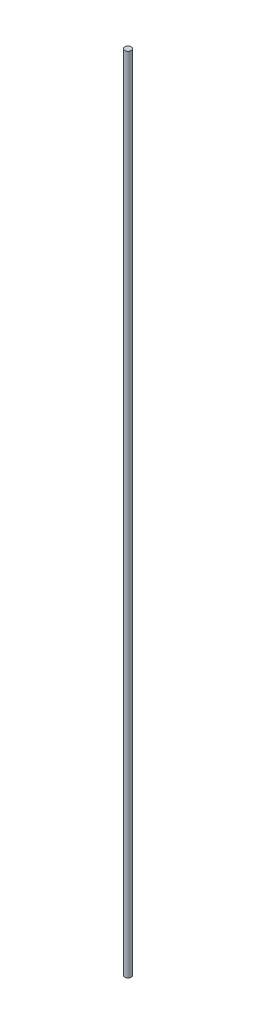
ISO-10303-21;
HEADER;
FILE_DESCRIPTION(('STEP AP214'),'2;1');
FILE_NAME('part.step','',(''),(''),'','','');
FILE_SCHEMA(('AUTOMOTIVE_DESIGN { 1 0 10303 214 1 1 1 1 }'));
ENDSEC;
DATA;
#1=APPLICATION_CONTEXT('core data for automotive mechanical design processes');
#2=APPLICATION_PROTOCOL_DEFINITION('international standard','automotive_design',2000,#1);
#3=PRODUCT_CONTEXT('',#1,'mechanical');
#4=PRODUCT('Part','Part','',(#3));
#5=PRODUCT_RELATED_PRODUCT_CATEGORY('part','',(#4));
#6=PRODUCT_DEFINITION_FORMATION('','',#4);
#7=PRODUCT_DEFINITION_CONTEXT('part definition',#1,'design');
#8=PRODUCT_DEFINITION('design','',#6,#7);
#9=PRODUCT_DEFINITION_SHAPE('','',#8);
#10=(LENGTH_UNIT() NAMED_UNIT(*) SI_UNIT(.MILLI.,.METRE.));
#11=(NAMED_UNIT(*) PLANE_ANGLE_UNIT() SI_UNIT($,.RADIAN.));
#12=(NAMED_UNIT(*) SI_UNIT($,.STERADIAN.) SOLID_ANGLE_UNIT());
#13=UNCERTAINTY_MEASURE_WITH_UNIT(LENGTH_MEASURE(1.E-05),#10,'distance_accuracy_value','');
#14=(GEOMETRIC_REPRESENTATION_CONTEXT(3) GLOBAL_UNCERTAINTY_ASSIGNED_CONTEXT((#13)) GLOBAL_UNIT_ASSIGNED_CONTEXT((#10,
#11,#12)) REPRESENTATION_CONTEXT('',''));
#15=CARTESIAN_POINT('',(0.,0.,0.));
#16=DIRECTION('',(0.,0.,1.));
#17=DIRECTION('',(1.,0.,0.));
#18=AXIS2_PLACEMENT_3D('',#15,#16,#17);
#19=CARTESIAN_POINT('',(-8.88178419700125E-13,1244.59999999999,-6.66133814775094E-13));
#20=DIRECTION('',(0.,-0.999999999999998,0.));
#21=DIRECTION('',(0.,0.,-1.));
#22=AXIS2_PLACEMENT_3D('',#19,#20,#21);
#23=CYLINDRICAL_SURFACE('',#22,5.08);
#24=CARTESIAN_POINT('',(-8.88178419700125E-13,1244.59999999999,-6.66133814775094E-13));
#25=DIRECTION('',(0.,0.999999999999998,0.));
#26=DIRECTION('',(0.,0.,1.));
#27=AXIS2_PLACEMENT_3D('',#24,#25,#26);
#28=CIRCLE('',#27,5.08);
#29=CARTESIAN_POINT('',(-8.89870399589654E-13,1244.59999999999,5.07999999999933));
#30=VERTEX_POINT('',#29);
#31=EDGE_CURVE('E12',#30,#30,#28,.T.);
#32=ORIENTED_EDGE('',*,*,#31,.F.);
#33=EDGE_LOOP('',(#32));
#34=FACE_BOUND('',#33,.T.);
#35=CARTESIAN_POINT('',(0.,0.,0.));
#36=DIRECTION('',(0.,0.999999999999998,0.));
#37=DIRECTION('',(0.,0.,1.));
#38=AXIS2_PLACEMENT_3D('',#35,#36,#37);
#39=CIRCLE('',#38,5.08);
#40=CARTESIAN_POINT('',(0.,0.,5.08));
#41=VERTEX_POINT('',#40);
#42=EDGE_CURVE('E49',#41,#41,#39,.T.);
#43=ORIENTED_EDGE('',*,*,#42,.T.);
#44=EDGE_LOOP('',(#43));
#45=FACE_BOUND('',#44,.T.);
#46=ADVANCED_FACE('F46',(#34,#45),#23,.T.);
#47=CARTESIAN_POINT('',(-8.88178419700125E-13,1244.59999999999,-6.66133814775094E-13));
#48=DIRECTION('',(0.,0.999999999999998,0.));
#49=DIRECTION('',(0.,0.,1.));
#50=AXIS2_PLACEMENT_3D('',#47,#48,#49);
#51=PLANE('',#50);
#52=ORIENTED_EDGE('',*,*,#31,.T.);
#53=EDGE_LOOP('',(#52));
#54=FACE_BOUND('',#53,.T.);
#55=ADVANCED_FACE('F61',(#54),#51,.T.);
#56=CARTESIAN_POINT('',(0.,0.,0.));
#57=DIRECTION('',(0.,0.999999999999998,0.));
#58=DIRECTION('',(0.,0.,1.));
#59=AXIS2_PLACEMENT_3D('',#56,#57,#58);
#60=PLANE('',#59);
#61=ORIENTED_EDGE('',*,*,#42,.F.);
#62=EDGE_LOOP('',(#61));
#63=FACE_BOUND('',#62,.T.);
#64=ADVANCED_FACE('F59',(#63),#60,.F.);
#65=CLOSED_SHELL('',(#46,#55,#64));
#66=MANIFOLD_SOLID_BREP('B2',#65);
#67=ADVANCED_BREP_SHAPE_REPRESENTATION('',(#18,#66),#14);
#68=SHAPE_DEFINITION_REPRESENTATION(#9,#67);
ENDSEC;
END-ISO-10303-21;
